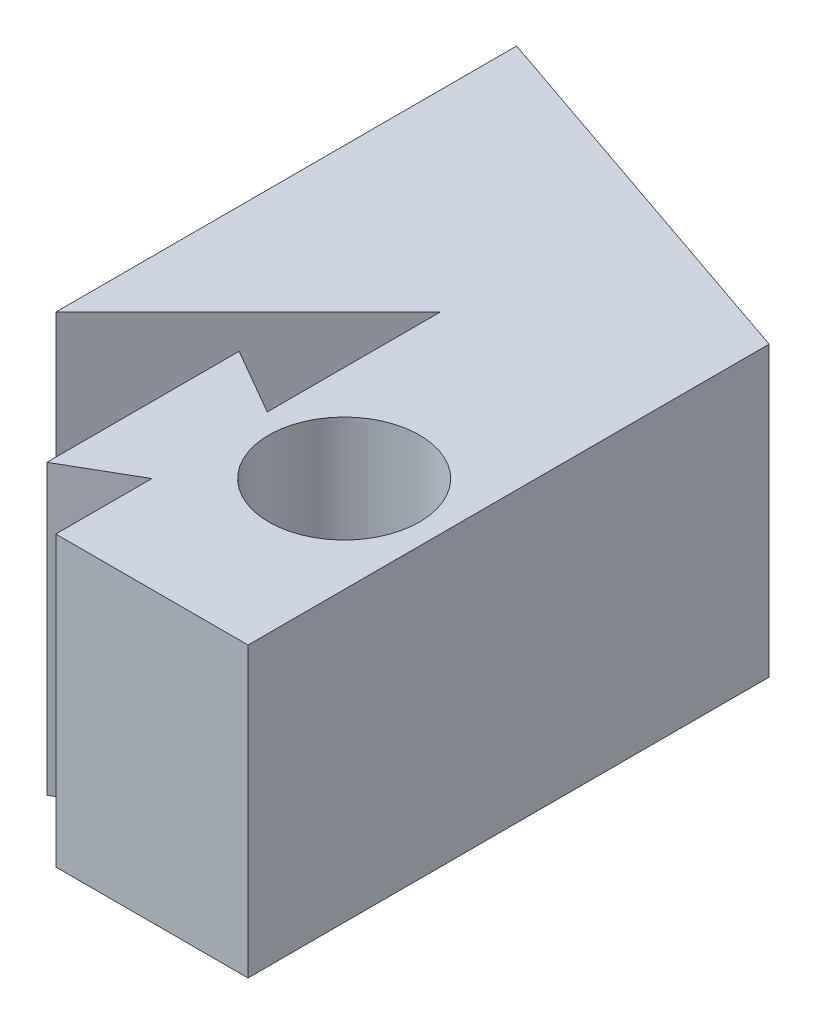
ISO-10303-21;
HEADER;
FILE_DESCRIPTION(('STEP AP214'),'2;1');
FILE_NAME('part.step','',(''),(''),'','','');
FILE_SCHEMA(('AUTOMOTIVE_DESIGN { 1 0 10303 214 1 1 1 1 }'));
ENDSEC;
DATA;
#1=APPLICATION_CONTEXT('core data for automotive mechanical design processes');
#2=APPLICATION_PROTOCOL_DEFINITION('international standard','automotive_design',2000,#1);
#3=PRODUCT_CONTEXT('',#1,'mechanical');
#4=PRODUCT('Part','Part','',(#3));
#5=PRODUCT_RELATED_PRODUCT_CATEGORY('part','',(#4));
#6=PRODUCT_DEFINITION_FORMATION('','',#4);
#7=PRODUCT_DEFINITION_CONTEXT('part definition',#1,'design');
#8=PRODUCT_DEFINITION('design','',#6,#7);
#9=PRODUCT_DEFINITION_SHAPE('','',#8);
#10=(LENGTH_UNIT() NAMED_UNIT(*) SI_UNIT(.MILLI.,.METRE.));
#11=(NAMED_UNIT(*) PLANE_ANGLE_UNIT() SI_UNIT($,.RADIAN.));
#12=(NAMED_UNIT(*) SI_UNIT($,.STERADIAN.) SOLID_ANGLE_UNIT());
#13=UNCERTAINTY_MEASURE_WITH_UNIT(LENGTH_MEASURE(1.E-05),#10,'distance_accuracy_value','');
#14=(GEOMETRIC_REPRESENTATION_CONTEXT(3) GLOBAL_UNCERTAINTY_ASSIGNED_CONTEXT((#13)) GLOBAL_UNIT_ASSIGNED_CONTEXT((#10,
#11,#12)) REPRESENTATION_CONTEXT('',''));
#15=CARTESIAN_POINT('',(0.,0.,0.));
#16=DIRECTION('',(0.,0.,1.));
#17=DIRECTION('',(1.,0.,0.));
#18=AXIS2_PLACEMENT_3D('',#15,#16,#17);
#19=CARTESIAN_POINT('',(6.35,9.525,-6.35000000000001));
#20=DIRECTION('',(0.,1.,0.));
#21=DIRECTION('',(0.,0.,1.));
#22=AXIS2_PLACEMENT_3D('',#19,#20,#21);
#23=PLANE('',#22);
#24=CARTESIAN_POINT('',(6.35,9.525,-6.35000000000001));
#25=DIRECTION('',(0.,1.,0.));
#26=DIRECTION('',(0.,0.,1.));
#27=AXIS2_PLACEMENT_3D('',#24,#25,#26);
#28=CIRCLE('',#27,2.4892);
#29=CARTESIAN_POINT('',(6.35,9.525,-3.86080000000001));
#30=VERTEX_POINT('',#29);
#31=EDGE_CURVE('E212',#30,#30,#28,.T.);
#32=ORIENTED_EDGE('',*,*,#31,.F.);
#33=EDGE_LOOP('',(#32));
#34=FACE_BOUND('',#33,.T.);
#35=DIRECTION('',(0.866025403784439,0.,-0.499999999999999));
#36=VECTOR('',#35,1.);
#37=CARTESIAN_POINT('',(-0.581065328507795,9.525,-1.0064346714922));
#38=LINE('',#37,#36);
#39=CARTESIAN_POINT('',(0.975295474387534,9.525,-1.905));
#40=VERTEX_POINT('',#39);
#41=CARTESIAN_POINT('',(3.17500000000001,9.525,-3.175));
#42=VERTEX_POINT('',#41);
#43=EDGE_CURVE('E156',#40,#42,#38,.T.);
#44=ORIENTED_EDGE('',*,*,#43,.T.);
#45=DIRECTION('',(0.,0.,1.));
#46=VECTOR('',#45,1.);
#47=CARTESIAN_POINT('',(3.17500000000001,9.525,0.));
#48=LINE('',#47,#46);
#49=CARTESIAN_POINT('',(3.17500000000001,9.525,0.));
#50=VERTEX_POINT('',#49);
#51=EDGE_CURVE('E192',#42,#50,#48,.T.);
#52=ORIENTED_EDGE('',*,*,#51,.T.);
#53=DIRECTION('',(-1.,0.,0.));
#54=VECTOR('',#53,1.);
#55=CARTESIAN_POINT('',(0.,9.525,0.));
#56=LINE('',#55,#54);
#57=CARTESIAN_POINT('',(9.525,9.525,0.));
#58=VERTEX_POINT('',#57);
#59=EDGE_CURVE('E149',#58,#50,#56,.T.);
#60=ORIENTED_EDGE('',*,*,#59,.F.);
#61=DIRECTION('',(0.,0.,1.));
#62=VECTOR('',#61,1.);
#63=CARTESIAN_POINT('',(9.525,9.525,0.));
#64=LINE('',#63,#62);
#65=CARTESIAN_POINT('',(9.52500000000006,9.525,-17.212483646232));
#66=VERTEX_POINT('',#65);
#67=EDGE_CURVE('E140',#66,#58,#64,.T.);
#68=ORIENTED_EDGE('',*,*,#67,.F.);
#69=DIRECTION('',(-0.945844813607445,0.,-0.32461914387771));
#70=VECTOR('',#69,1.);
#71=CARTESIAN_POINT('',(9.52500000000006,9.525,-17.212483646232));
#72=LINE('',#71,#70);
#73=CARTESIAN_POINT('',(-3.17499999999995,9.525,-21.5711935190738));
#74=VERTEX_POINT('',#73);
#75=EDGE_CURVE('E221',#66,#74,#72,.T.);
#76=ORIENTED_EDGE('',*,*,#75,.T.);
#77=DIRECTION('',(0.,0.,1.));
#78=VECTOR('',#77,1.);
#79=CARTESIAN_POINT('',(-3.175,9.525,-12.7));
#80=LINE('',#79,#78);
#81=CARTESIAN_POINT('',(-3.175,9.525,-6.35000000000001));
#82=VERTEX_POINT('',#81);
#83=EDGE_CURVE('E202',#74,#82,#80,.T.);
#84=ORIENTED_EDGE('',*,*,#83,.T.);
#85=DIRECTION('',(0.707106781186548,0.,-0.707106781186547));
#86=VECTOR('',#85,1.);
#87=CARTESIAN_POINT('',(-4.7625,9.525,-4.76250000000001));
#88=LINE('',#87,#86);
#89=CARTESIAN_POINT('',(3.17499999999999,9.525,-12.7));
#90=VERTEX_POINT('',#89);
#91=EDGE_CURVE('E210',#82,#90,#88,.T.);
#92=ORIENTED_EDGE('',*,*,#91,.T.);
#93=DIRECTION('',(0.,0.,1.));
#94=VECTOR('',#93,1.);
#95=CARTESIAN_POINT('',(3.17500000000003,9.525,0.));
#96=LINE('',#95,#94);
#97=CARTESIAN_POINT('',(3.17500000000001,9.525,-6.985));
#98=VERTEX_POINT('',#97);
#99=EDGE_CURVE('E180',#90,#98,#96,.T.);
#100=ORIENTED_EDGE('',*,*,#99,.T.);
#101=DIRECTION('',(-0.866025403784438,0.,-0.500000000000001));
#102=VECTOR('',#101,1.);
#103=CARTESIAN_POINT('',(3.81834372271716,9.525,-6.6135653285078));
#104=LINE('',#103,#102);
#105=CARTESIAN_POINT('',(0.975295474387533,9.525,-8.255));
#106=VERTEX_POINT('',#105);
#107=EDGE_CURVE('E197',#98,#106,#104,.T.);
#108=ORIENTED_EDGE('',*,*,#107,.T.);
#109=DIRECTION('',(0.,0.,1.));
#110=VECTOR('',#109,1.);
#111=CARTESIAN_POINT('',(0.975295474387535,9.525,0.));
#112=LINE('',#111,#110);
#113=EDGE_CURVE('E164',#106,#40,#112,.T.);
#114=ORIENTED_EDGE('',*,*,#113,.T.);
#115=EDGE_LOOP('',(#44,#52,#60,#68,#76,#84,#92,#100,#108,#114));
#116=FACE_BOUND('',#115,.T.);
#117=ADVANCED_FACE('F69',(#34,#116),#23,.T.);
#118=CARTESIAN_POINT('',(-0.581065328507795,-15.3097174198376,-1.0064346714922));
#119=DIRECTION('',(0.499999999999999,0.,0.866025403784439));
#120=DIRECTION('',(0.866025403784439,0.,-0.499999999999999));
#121=AXIS2_PLACEMENT_3D('',#118,#119,#120);
#122=PLANE('',#121);
#123=DIRECTION('',(-0.866025403784439,0.,0.499999999999999));
#124=VECTOR('',#123,1.);
#125=CARTESIAN_POINT('',(-0.581065328507795,0.,-1.0064346714922));
#126=LINE('',#125,#124);
#127=CARTESIAN_POINT('',(3.17500000000001,0.,-3.175));
#128=VERTEX_POINT('',#127);
#129=CARTESIAN_POINT('',(0.975295474387534,0.,-1.905));
#130=VERTEX_POINT('',#129);
#131=EDGE_CURVE('E115',#128,#130,#126,.T.);
#132=ORIENTED_EDGE('',*,*,#131,.F.);
#133=DIRECTION('',(0.,1.,0.));
#134=VECTOR('',#133,1.);
#135=CARTESIAN_POINT('',(3.17500000000001,-15.3097174198376,-3.175));
#136=LINE('',#135,#134);
#137=EDGE_CURVE('E157',#128,#42,#136,.T.);
#138=ORIENTED_EDGE('',*,*,#137,.T.);
#139=ORIENTED_EDGE('',*,*,#43,.F.);
#140=DIRECTION('',(0.,1.,0.));
#141=VECTOR('',#140,1.);
#142=CARTESIAN_POINT('',(0.975295474387534,-15.3097174198376,-1.905));
#143=LINE('',#142,#141);
#144=EDGE_CURVE('E160',#130,#40,#143,.T.);
#145=ORIENTED_EDGE('',*,*,#144,.F.);
#146=EDGE_LOOP('',(#132,#138,#139,#145));
#147=FACE_BOUND('',#146,.T.);
#148=ADVANCED_FACE('F254',(#147),#122,.T.);
#149=CARTESIAN_POINT('',(0.975295474387535,-15.3097174198376,0.));
#150=DIRECTION('',(-1.,0.,0.));
#151=DIRECTION('',(0.,0.,1.));
#152=AXIS2_PLACEMENT_3D('',#149,#150,#151);
#153=PLANE('',#152);
#154=DIRECTION('',(0.,0.,-1.));
#155=VECTOR('',#154,1.);
#156=CARTESIAN_POINT('',(0.975295474387535,0.,0.));
#157=LINE('',#156,#155);
#158=CARTESIAN_POINT('',(0.975295474387533,0.,-8.255));
#159=VERTEX_POINT('',#158);
#160=EDGE_CURVE('E163',#130,#159,#157,.T.);
#161=ORIENTED_EDGE('',*,*,#160,.F.);
#162=ORIENTED_EDGE('',*,*,#144,.T.);
#163=ORIENTED_EDGE('',*,*,#113,.F.);
#164=DIRECTION('',(0.,1.,0.));
#165=VECTOR('',#164,1.);
#166=CARTESIAN_POINT('',(0.975295474387533,-15.3097174198376,-8.255));
#167=LINE('',#166,#165);
#168=EDGE_CURVE('E185',#159,#106,#167,.T.);
#169=ORIENTED_EDGE('',*,*,#168,.F.);
#170=EDGE_LOOP('',(#161,#162,#163,#169));
#171=FACE_BOUND('',#170,.T.);
#172=ADVANCED_FACE('F250',(#171),#153,.T.);
#173=CARTESIAN_POINT('',(3.81834372271716,-15.3097174198376,-6.6135653285078));
#174=DIRECTION('',(0.5,0.,-0.866025403784438));
#175=DIRECTION('',(-0.866025403784438,0.,-0.500000000000001));
#176=AXIS2_PLACEMENT_3D('',#173,#174,#175);
#177=PLANE('',#176);
#178=DIRECTION('',(0.866025403784438,0.,0.500000000000001));
#179=VECTOR('',#178,1.);
#180=CARTESIAN_POINT('',(3.81834372271716,0.,-6.6135653285078));
#181=LINE('',#180,#179);
#182=CARTESIAN_POINT('',(3.17500000000001,0.,-6.985));
#183=VERTEX_POINT('',#182);
#184=EDGE_CURVE('E125',#159,#183,#181,.T.);
#185=ORIENTED_EDGE('',*,*,#184,.F.);
#186=ORIENTED_EDGE('',*,*,#168,.T.);
#187=ORIENTED_EDGE('',*,*,#107,.F.);
#188=DIRECTION('',(0.,1.,0.));
#189=VECTOR('',#188,1.);
#190=CARTESIAN_POINT('',(3.17500000000001,-15.3097174198376,-6.985));
#191=LINE('',#190,#189);
#192=EDGE_CURVE('E184',#183,#98,#191,.T.);
#193=ORIENTED_EDGE('',*,*,#192,.F.);
#194=EDGE_LOOP('',(#185,#186,#187,#193));
#195=FACE_BOUND('',#194,.T.);
#196=ADVANCED_FACE('F276',(#195),#177,.T.);
#197=CARTESIAN_POINT('',(3.17500000000003,-15.3097174198376,0.));
#198=DIRECTION('',(-1.,0.,0.));
#199=DIRECTION('',(0.,0.,1.));
#200=AXIS2_PLACEMENT_3D('',#197,#198,#199);
#201=PLANE('',#200);
#202=DIRECTION('',(0.,0.,-1.));
#203=VECTOR('',#202,1.);
#204=CARTESIAN_POINT('',(3.17500000000003,0.,0.));
#205=LINE('',#204,#203);
#206=CARTESIAN_POINT('',(3.17499999999999,0.,-12.7));
#207=VERTEX_POINT('',#206);
#208=EDGE_CURVE('E79',#183,#207,#205,.T.);
#209=ORIENTED_EDGE('',*,*,#208,.F.);
#210=ORIENTED_EDGE('',*,*,#192,.T.);
#211=ORIENTED_EDGE('',*,*,#99,.F.);
#212=DIRECTION('',(0.,1.,0.));
#213=VECTOR('',#212,1.);
#214=CARTESIAN_POINT('',(3.17499999999999,-15.3097174198376,-12.7));
#215=LINE('',#214,#213);
#216=EDGE_CURVE('E141',#207,#90,#215,.T.);
#217=ORIENTED_EDGE('',*,*,#216,.F.);
#218=EDGE_LOOP('',(#209,#210,#211,#217));
#219=FACE_BOUND('',#218,.T.);
#220=ADVANCED_FACE('F178',(#219),#201,.T.);
#221=CARTESIAN_POINT('',(9.525,-15.3097174198376,0.));
#222=DIRECTION('',(-1.,0.,0.));
#223=DIRECTION('',(0.,0.,1.));
#224=AXIS2_PLACEMENT_3D('',#221,#222,#223);
#225=PLANE('',#224);
#226=DIRECTION('',(0.,1.,0.));
#227=VECTOR('',#226,1.);
#228=CARTESIAN_POINT('',(9.525,-15.3097174198376,0.));
#229=LINE('',#228,#227);
#230=CARTESIAN_POINT('',(9.525,0.,0.));
#231=VERTEX_POINT('',#230);
#232=EDGE_CURVE('E144',#231,#58,#229,.T.);
#233=ORIENTED_EDGE('',*,*,#232,.F.);
#234=DIRECTION('',(0.,0.,-1.));
#235=VECTOR('',#234,1.);
#236=CARTESIAN_POINT('',(9.525,0.,0.));
#237=LINE('',#236,#235);
#238=CARTESIAN_POINT('',(9.52500000000006,0.,-17.212483646232));
#239=VERTEX_POINT('',#238);
#240=EDGE_CURVE('E130',#231,#239,#237,.T.);
#241=ORIENTED_EDGE('',*,*,#240,.T.);
#242=DIRECTION('',(0.,1.,0.));
#243=VECTOR('',#242,1.);
#244=CARTESIAN_POINT('',(9.52500000000006,-14.8009507435979,-17.212483646232));
#245=LINE('',#244,#243);
#246=EDGE_CURVE('E218',#239,#66,#245,.T.);
#247=ORIENTED_EDGE('',*,*,#246,.T.);
#248=ORIENTED_EDGE('',*,*,#67,.T.);
#249=EDGE_LOOP('',(#233,#241,#247,#248));
#250=FACE_BOUND('',#249,.T.);
#251=ADVANCED_FACE('F147',(#250),#225,.F.);
#252=CARTESIAN_POINT('',(0.,-15.3097174198376,0.));
#253=DIRECTION('',(0.,0.,-1.));
#254=DIRECTION('',(-1.,0.,0.));
#255=AXIS2_PLACEMENT_3D('',#252,#253,#254);
#256=PLANE('',#255);
#257=DIRECTION('',(0.,1.,0.));
#258=VECTOR('',#257,1.);
#259=CARTESIAN_POINT('',(3.17500000000001,-15.3097174198376,0.));
#260=LINE('',#259,#258);
#261=CARTESIAN_POINT('',(3.17500000000001,0.,0.));
#262=VERTEX_POINT('',#261);
#263=EDGE_CURVE('E110',#262,#50,#260,.T.);
#264=ORIENTED_EDGE('',*,*,#263,.F.);
#265=DIRECTION('',(1.,0.,0.));
#266=VECTOR('',#265,1.);
#267=CARTESIAN_POINT('',(0.,0.,0.));
#268=LINE('',#267,#266);
#269=EDGE_CURVE('E73',#262,#231,#268,.T.);
#270=ORIENTED_EDGE('',*,*,#269,.T.);
#271=ORIENTED_EDGE('',*,*,#232,.T.);
#272=ORIENTED_EDGE('',*,*,#59,.T.);
#273=EDGE_LOOP('',(#264,#270,#271,#272));
#274=FACE_BOUND('',#273,.T.);
#275=ADVANCED_FACE('F143',(#274),#256,.F.);
#276=CARTESIAN_POINT('',(3.17500000000001,-15.3097174198376,0.));
#277=DIRECTION('',(-1.,0.,0.));
#278=DIRECTION('',(0.,0.,1.));
#279=AXIS2_PLACEMENT_3D('',#276,#277,#278);
#280=PLANE('',#279);
#281=DIRECTION('',(0.,0.,-1.));
#282=VECTOR('',#281,1.);
#283=CARTESIAN_POINT('',(3.17500000000001,0.,0.));
#284=LINE('',#283,#282);
#285=EDGE_CURVE('E12',#262,#128,#284,.T.);
#286=ORIENTED_EDGE('',*,*,#285,.F.);
#287=ORIENTED_EDGE('',*,*,#263,.T.);
#288=ORIENTED_EDGE('',*,*,#51,.F.);
#289=ORIENTED_EDGE('',*,*,#137,.F.);
#290=EDGE_LOOP('',(#286,#287,#288,#289));
#291=FACE_BOUND('',#290,.T.);
#292=ADVANCED_FACE('F256',(#291),#280,.T.);
#293=CARTESIAN_POINT('',(6.35,0.,-6.35000000000001));
#294=DIRECTION('',(0.,1.,0.));
#295=DIRECTION('',(0.,0.,1.));
#296=AXIS2_PLACEMENT_3D('',#293,#294,#295);
#297=PLANE('',#296);
#298=CARTESIAN_POINT('',(6.35,0.,-6.35000000000001));
#299=DIRECTION('',(0.,1.,0.));
#300=DIRECTION('',(0.,0.,1.));
#301=AXIS2_PLACEMENT_3D('',#298,#299,#300);
#302=CIRCLE('',#301,2.4892);
#303=CARTESIAN_POINT('',(6.35,0.,-3.86080000000001));
#304=VERTEX_POINT('',#303);
#305=EDGE_CURVE('E215',#304,#304,#302,.T.);
#306=ORIENTED_EDGE('',*,*,#305,.T.);
#307=EDGE_LOOP('',(#306));
#308=FACE_BOUND('',#307,.T.);
#309=ORIENTED_EDGE('',*,*,#131,.T.);
#310=ORIENTED_EDGE('',*,*,#160,.T.);
#311=ORIENTED_EDGE('',*,*,#184,.T.);
#312=ORIENTED_EDGE('',*,*,#208,.T.);
#313=DIRECTION('',(-0.707106781186548,0.,0.707106781186547));
#314=VECTOR('',#313,1.);
#315=CARTESIAN_POINT('',(-4.7625,0.,-4.76250000000001));
#316=LINE('',#315,#314);
#317=CARTESIAN_POINT('',(-3.175,0.,-6.35000000000001));
#318=VERTEX_POINT('',#317);
#319=EDGE_CURVE('E171',#207,#318,#316,.T.);
#320=ORIENTED_EDGE('',*,*,#319,.T.);
#321=DIRECTION('',(0.,0.,-1.));
#322=VECTOR('',#321,1.);
#323=CARTESIAN_POINT('',(-3.175,0.,-12.7));
#324=LINE('',#323,#322);
#325=CARTESIAN_POINT('',(-3.17499999999996,0.,-21.5711935190738));
#326=VERTEX_POINT('',#325);
#327=EDGE_CURVE('E161',#318,#326,#324,.T.);
#328=ORIENTED_EDGE('',*,*,#327,.T.);
#329=DIRECTION('',(0.945844813607445,0.,0.32461914387771));
#330=VECTOR('',#329,1.);
#331=CARTESIAN_POINT('',(9.52500000000006,0.,-17.212483646232));
#332=LINE('',#331,#330);
#333=EDGE_CURVE('E135',#326,#239,#332,.T.);
#334=ORIENTED_EDGE('',*,*,#333,.T.);
#335=ORIENTED_EDGE('',*,*,#240,.F.);
#336=ORIENTED_EDGE('',*,*,#269,.F.);
#337=ORIENTED_EDGE('',*,*,#285,.T.);
#338=EDGE_LOOP('',(#309,#310,#311,#312,#320,#328,#334,#335,#336,#337));
#339=FACE_BOUND('',#338,.T.);
#340=ADVANCED_FACE('F71',(#308,#339),#297,.F.);
#341=CARTESIAN_POINT('',(-3.175,-12.7633420388235,-12.7));
#342=DIRECTION('',(-1.,0.,0.));
#343=DIRECTION('',(0.,0.,1.));
#344=AXIS2_PLACEMENT_3D('',#341,#342,#343);
#345=PLANE('',#344);
#346=ORIENTED_EDGE('',*,*,#327,.F.);
#347=DIRECTION('',(0.,1.,0.));
#348=VECTOR('',#347,1.);
#349=CARTESIAN_POINT('',(-3.175,-15.3097174198376,-6.35000000000001));
#350=LINE('',#349,#348);
#351=EDGE_CURVE('E207',#318,#82,#350,.T.);
#352=ORIENTED_EDGE('',*,*,#351,.T.);
#353=ORIENTED_EDGE('',*,*,#83,.F.);
#354=DIRECTION('',(0.,1.,0.));
#355=VECTOR('',#354,1.);
#356=CARTESIAN_POINT('',(-3.17499999999995,-14.8009507435979,-21.5711935190738));
#357=LINE('',#356,#355);
#358=EDGE_CURVE('E220',#326,#74,#357,.T.);
#359=ORIENTED_EDGE('',*,*,#358,.F.);
#360=EDGE_LOOP('',(#346,#352,#353,#359));
#361=FACE_BOUND('',#360,.T.);
#362=ADVANCED_FACE('F244',(#361),#345,.T.);
#363=CARTESIAN_POINT('',(-4.7625,-15.3097174198376,-4.76250000000001));
#364=DIRECTION('',(0.707106781186547,0.,0.707106781186548));
#365=DIRECTION('',(0.707106781186548,0.,-0.707106781186547));
#366=AXIS2_PLACEMENT_3D('',#363,#364,#365);
#367=PLANE('',#366);
#368=ORIENTED_EDGE('',*,*,#319,.F.);
#369=ORIENTED_EDGE('',*,*,#216,.T.);
#370=ORIENTED_EDGE('',*,*,#91,.F.);
#371=ORIENTED_EDGE('',*,*,#351,.F.);
#372=EDGE_LOOP('',(#368,#369,#370,#371));
#373=FACE_BOUND('',#372,.T.);
#374=ADVANCED_FACE('F245',(#373),#367,.T.);
#375=CARTESIAN_POINT('',(6.35,0.,-6.35000000000001));
#376=DIRECTION('',(0.,1.,0.));
#377=DIRECTION('',(0.,0.,1.));
#378=AXIS2_PLACEMENT_3D('',#375,#376,#377);
#379=CYLINDRICAL_SURFACE('',#378,2.4892);
#380=ORIENTED_EDGE('',*,*,#31,.T.);
#381=EDGE_LOOP('',(#380));
#382=FACE_BOUND('',#381,.T.);
#383=ORIENTED_EDGE('',*,*,#305,.F.);
#384=EDGE_LOOP('',(#383));
#385=FACE_BOUND('',#384,.T.);
#386=ADVANCED_FACE('F314',(#382,#385),#379,.F.);
#387=CARTESIAN_POINT('',(9.52500000000006,-14.8009507435979,-17.212483646232));
#388=DIRECTION('',(0.32461914387771,0.,-0.945844813607445));
#389=DIRECTION('',(-0.945844813607445,0.,-0.32461914387771));
#390=AXIS2_PLACEMENT_3D('',#387,#388,#389);
#391=PLANE('',#390);
#392=ORIENTED_EDGE('',*,*,#333,.F.);
#393=ORIENTED_EDGE('',*,*,#358,.T.);
#394=ORIENTED_EDGE('',*,*,#75,.F.);
#395=ORIENTED_EDGE('',*,*,#246,.F.);
#396=EDGE_LOOP('',(#392,#393,#394,#395));
#397=FACE_BOUND('',#396,.T.);
#398=ADVANCED_FACE('F234',(#397),#391,.T.);
#399=CLOSED_SHELL('',(#117,#148,#172,#196,#220,#251,#275,#292,#340,#362,#374,#386,#398));
#400=MANIFOLD_SOLID_BREP('B2',#399);
#401=ADVANCED_BREP_SHAPE_REPRESENTATION('',(#18,#400),#14);
#402=SHAPE_DEFINITION_REPRESENTATION(#9,#401);
ENDSEC;
END-ISO-10303-21;
